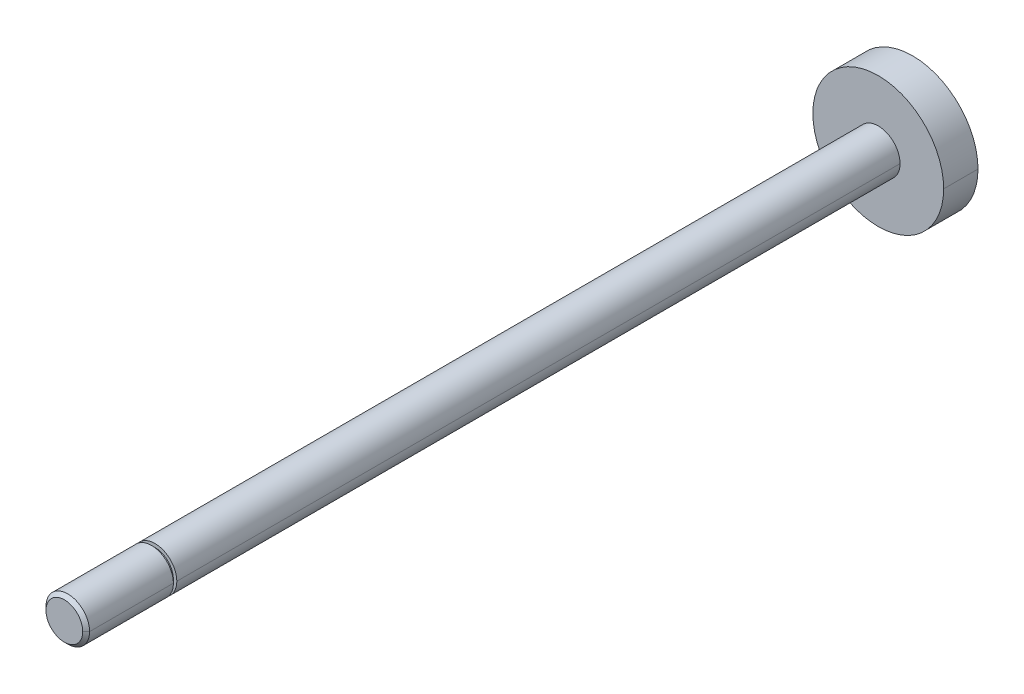
ISO-10303-21;
HEADER;
FILE_DESCRIPTION(('STEP AP214'),'2;1');
FILE_NAME('part.step','',(''),(''),'','','');
FILE_SCHEMA(('AUTOMOTIVE_DESIGN { 1 0 10303 214 1 1 1 1 }'));
ENDSEC;
DATA;
#1=APPLICATION_CONTEXT('core data for automotive mechanical design processes');
#2=APPLICATION_PROTOCOL_DEFINITION('international standard','automotive_design',2000,#1);
#3=PRODUCT_CONTEXT('',#1,'mechanical');
#4=PRODUCT('Part','Part','',(#3));
#5=PRODUCT_RELATED_PRODUCT_CATEGORY('part','',(#4));
#6=PRODUCT_DEFINITION_FORMATION('','',#4);
#7=PRODUCT_DEFINITION_CONTEXT('part definition',#1,'design');
#8=PRODUCT_DEFINITION('design','',#6,#7);
#9=PRODUCT_DEFINITION_SHAPE('','',#8);
#10=(LENGTH_UNIT() NAMED_UNIT(*) SI_UNIT(.MILLI.,.METRE.));
#11=(NAMED_UNIT(*) PLANE_ANGLE_UNIT() SI_UNIT($,.RADIAN.));
#12=(NAMED_UNIT(*) SI_UNIT($,.STERADIAN.) SOLID_ANGLE_UNIT());
#13=UNCERTAINTY_MEASURE_WITH_UNIT(LENGTH_MEASURE(1.E-05),#10,'distance_accuracy_value','');
#14=(GEOMETRIC_REPRESENTATION_CONTEXT(3) GLOBAL_UNCERTAINTY_ASSIGNED_CONTEXT((#13)) GLOBAL_UNIT_ASSIGNED_CONTEXT((#10,
#11,#12)) REPRESENTATION_CONTEXT('',''));
#15=CARTESIAN_POINT('',(0.,0.,0.));
#16=DIRECTION('',(0.,0.,1.));
#17=DIRECTION('',(1.,0.,0.));
#18=AXIS2_PLACEMENT_3D('',#15,#16,#17);
#19=CARTESIAN_POINT('',(0.,0.,121.031));
#20=DIRECTION('',(0.,0.,-1.));
#21=DIRECTION('',(0.,-1.,0.));
#22=AXIS2_PLACEMENT_3D('',#19,#20,#21);
#23=PLANE('',#22);
#24=CARTESIAN_POINT('',(0.,0.,121.031));
#25=DIRECTION('',(0.,0.,-1.));
#26=DIRECTION('',(-1.,0.,0.));
#27=AXIS2_PLACEMENT_3D('',#24,#25,#26);
#28=CIRCLE('',#27,2.675);
#29=CARTESIAN_POINT('',(-2.675,0.,121.031));
#30=VERTEX_POINT('',#29);
#31=CARTESIAN_POINT('',(2.675,0.,121.031));
#32=VERTEX_POINT('',#31);
#33=EDGE_CURVE('E558',#30,#32,#28,.T.);
#34=ORIENTED_EDGE('',*,*,#33,.F.);
#35=CARTESIAN_POINT('',(0.,0.,121.031));
#36=DIRECTION('',(0.,0.,-1.));
#37=DIRECTION('',(-1.,0.,0.));
#38=AXIS2_PLACEMENT_3D('',#35,#36,#37);
#39=CIRCLE('',#38,2.675);
#40=EDGE_CURVE('E11',#32,#30,#39,.T.);
#41=ORIENTED_EDGE('',*,*,#40,.F.);
#42=EDGE_LOOP('',(#34,#41));
#43=FACE_BOUND('',#42,.T.);
#44=ADVANCED_FACE('F16',(#43),#23,.F.);
#45=CARTESIAN_POINT('',(0.,0.,121.031));
#46=DIRECTION('',(0.,0.,-1.));
#47=DIRECTION('',(-1.,0.,0.));
#48=AXIS2_PLACEMENT_3D('',#45,#46,#47);
#49=CONICAL_SURFACE('',#48,2.675,0.785398163397466);
#50=DIRECTION('',(0.70710678118656,0.,-0.707106781186535));
#51=VECTOR('',#50,1.);
#52=CARTESIAN_POINT('',(2.675,0.,121.031));
#53=LINE('',#52,#51);
#54=CARTESIAN_POINT('',(3.175,0.,120.531));
#55=VERTEX_POINT('',#54);
#56=EDGE_CURVE('E553',#32,#55,#53,.T.);
#57=ORIENTED_EDGE('',*,*,#56,.F.);
#58=ORIENTED_EDGE('',*,*,#40,.T.);
#59=DIRECTION('',(-0.70710678118656,0.,-0.707106781186535));
#60=VECTOR('',#59,1.);
#61=CARTESIAN_POINT('',(-2.675,0.,121.031));
#62=LINE('',#61,#60);
#63=CARTESIAN_POINT('',(-3.175,0.,120.531));
#64=VERTEX_POINT('',#63);
#65=EDGE_CURVE('E182',#30,#64,#62,.T.);
#66=ORIENTED_EDGE('',*,*,#65,.T.);
#67=CARTESIAN_POINT('',(0.,0.,120.531));
#68=DIRECTION('',(0.,0.,-1.));
#69=DIRECTION('',(-1.,0.,0.));
#70=AXIS2_PLACEMENT_3D('',#67,#68,#69);
#71=CIRCLE('',#70,3.175);
#72=EDGE_CURVE('E26',#55,#64,#71,.T.);
#73=ORIENTED_EDGE('',*,*,#72,.F.);
#74=EDGE_LOOP('',(#57,#58,#66,#73));
#75=FACE_BOUND('',#74,.T.);
#76=ADVANCED_FACE('F325',(#75),#49,.T.);
#77=CARTESIAN_POINT('',(0.,0.,130.011256121069));
#78=DIRECTION('',(0.,0.,-1.));
#79=DIRECTION('',(-1.,0.,0.));
#80=AXIS2_PLACEMENT_3D('',#77,#78,#79);
#81=CYLINDRICAL_SURFACE('',#80,3.175);
#82=DIRECTION('',(0.,0.,-1.));
#83=VECTOR('',#82,1.);
#84=CARTESIAN_POINT('',(3.175,0.,130.011256121069));
#85=LINE('',#84,#83);
#86=CARTESIAN_POINT('',(3.175,0.,108.331));
#87=VERTEX_POINT('',#86);
#88=EDGE_CURVE('E186',#55,#87,#85,.T.);
#89=ORIENTED_EDGE('',*,*,#88,.F.);
#90=ORIENTED_EDGE('',*,*,#72,.T.);
#91=DIRECTION('',(0.,0.,-1.));
#92=VECTOR('',#91,1.);
#93=CARTESIAN_POINT('',(-3.175,0.,130.011256121069));
#94=LINE('',#93,#92);
#95=CARTESIAN_POINT('',(-3.175,0.,108.331));
#96=VERTEX_POINT('',#95);
#97=EDGE_CURVE('E191',#64,#96,#94,.T.);
#98=ORIENTED_EDGE('',*,*,#97,.T.);
#99=CARTESIAN_POINT('',(0.,0.,108.331));
#100=DIRECTION('',(0.,0.,-1.));
#101=DIRECTION('',(-1.,0.,0.));
#102=AXIS2_PLACEMENT_3D('',#99,#100,#101);
#103=CIRCLE('',#102,3.175);
#104=EDGE_CURVE('E148',#87,#96,#103,.T.);
#105=ORIENTED_EDGE('',*,*,#104,.F.);
#106=EDGE_LOOP('',(#89,#90,#98,#105));
#107=FACE_BOUND('',#106,.T.);
#108=ADVANCED_FACE('F398',(#107),#81,.T.);
#109=CARTESIAN_POINT('',(0.,0.,0.));
#110=DIRECTION('',(0.,0.,-1.));
#111=DIRECTION('',(-1.,0.,0.));
#112=AXIS2_PLACEMENT_3D('',#109,#110,#111);
#113=CYLINDRICAL_SURFACE('',#112,2.675);
#114=DIRECTION('',(0.,0.,-1.));
#115=VECTOR('',#114,1.);
#116=CARTESIAN_POINT('',(2.675,0.,0.));
#117=LINE('',#116,#115);
#118=CARTESIAN_POINT('',(2.675,0.,108.331));
#119=VERTEX_POINT('',#118);
#120=CARTESIAN_POINT('',(2.675,0.,107.831));
#121=VERTEX_POINT('',#120);
#122=EDGE_CURVE('E176',#119,#121,#117,.T.);
#123=ORIENTED_EDGE('',*,*,#122,.F.);
#124=CARTESIAN_POINT('',(0.,0.,108.331));
#125=DIRECTION('',(0.,0.,-1.));
#126=DIRECTION('',(-1.,0.,0.));
#127=AXIS2_PLACEMENT_3D('',#124,#125,#126);
#128=CIRCLE('',#127,2.675);
#129=CARTESIAN_POINT('',(-2.675,0.,108.331));
#130=VERTEX_POINT('',#129);
#131=EDGE_CURVE('E147',#119,#130,#128,.T.);
#132=ORIENTED_EDGE('',*,*,#131,.T.);
#133=DIRECTION('',(0.,0.,-1.));
#134=VECTOR('',#133,1.);
#135=CARTESIAN_POINT('',(-2.675,0.,0.));
#136=LINE('',#135,#134);
#137=CARTESIAN_POINT('',(-2.675,0.,107.831));
#138=VERTEX_POINT('',#137);
#139=EDGE_CURVE('E145',#130,#138,#136,.T.);
#140=ORIENTED_EDGE('',*,*,#139,.T.);
#141=CARTESIAN_POINT('',(0.,0.,107.831));
#142=DIRECTION('',(0.,0.,-1.));
#143=DIRECTION('',(-1.,0.,0.));
#144=AXIS2_PLACEMENT_3D('',#141,#142,#143);
#145=CIRCLE('',#144,2.675);
#146=EDGE_CURVE('E19',#121,#138,#145,.T.);
#147=ORIENTED_EDGE('',*,*,#146,.F.);
#148=EDGE_LOOP('',(#123,#132,#140,#147));
#149=FACE_BOUND('',#148,.T.);
#150=ADVANCED_FACE('F206',(#149),#113,.T.);
#151=CARTESIAN_POINT('',(0.,3.175,108.331));
#152=DIRECTION('',(0.,0.,1.));
#153=DIRECTION('',(1.,0.,0.));
#154=AXIS2_PLACEMENT_3D('',#151,#152,#153);
#155=PLANE('',#154);
#156=CARTESIAN_POINT('',(0.,0.,108.331));
#157=DIRECTION('',(0.,0.,-1.));
#158=DIRECTION('',(-1.,0.,0.));
#159=AXIS2_PLACEMENT_3D('',#156,#157,#158);
#160=CIRCLE('',#159,2.675);
#161=EDGE_CURVE('E188',#130,#119,#160,.T.);
#162=ORIENTED_EDGE('',*,*,#161,.F.);
#163=ORIENTED_EDGE('',*,*,#131,.F.);
#164=EDGE_LOOP('',(#162,#163));
#165=FACE_BOUND('',#164,.T.);
#166=CARTESIAN_POINT('',(0.,0.,108.331));
#167=DIRECTION('',(0.,0.,-1.));
#168=DIRECTION('',(-1.,0.,0.));
#169=AXIS2_PLACEMENT_3D('',#166,#167,#168);
#170=CIRCLE('',#169,3.175);
#171=EDGE_CURVE('E198',#96,#87,#170,.T.);
#172=ORIENTED_EDGE('',*,*,#171,.T.);
#173=ORIENTED_EDGE('',*,*,#104,.T.);
#174=EDGE_LOOP('',(#172,#173));
#175=FACE_BOUND('',#174,.T.);
#176=ADVANCED_FACE('F215',(#165,#175),#155,.F.);
#177=CARTESIAN_POINT('',(0.,2.675,107.831));
#178=DIRECTION('',(0.,0.,-1.));
#179=DIRECTION('',(0.,-1.,0.));
#180=AXIS2_PLACEMENT_3D('',#177,#178,#179);
#181=PLANE('',#180);
#182=CARTESIAN_POINT('',(0.,0.,107.831));
#183=DIRECTION('',(0.,0.,-1.));
#184=DIRECTION('',(-1.,0.,0.));
#185=AXIS2_PLACEMENT_3D('',#182,#183,#184);
#186=CIRCLE('',#185,2.675);
#187=EDGE_CURVE('E179',#138,#121,#186,.T.);
#188=ORIENTED_EDGE('',*,*,#187,.T.);
#189=ORIENTED_EDGE('',*,*,#146,.T.);
#190=EDGE_LOOP('',(#188,#189));
#191=FACE_BOUND('',#190,.T.);
#192=CARTESIAN_POINT('',(0.,0.,107.831));
#193=DIRECTION('',(0.,0.,-1.));
#194=DIRECTION('',(-1.,0.,0.));
#195=AXIS2_PLACEMENT_3D('',#192,#193,#194);
#196=CIRCLE('',#195,3.175);
#197=CARTESIAN_POINT('',(-3.175,0.,107.831));
#198=VERTEX_POINT('',#197);
#199=CARTESIAN_POINT('',(3.175,0.,107.831));
#200=VERTEX_POINT('',#199);
#201=EDGE_CURVE('E140',#198,#200,#196,.T.);
#202=ORIENTED_EDGE('',*,*,#201,.F.);
#203=CARTESIAN_POINT('',(0.,0.,107.831));
#204=DIRECTION('',(0.,0.,-1.));
#205=DIRECTION('',(-1.,0.,0.));
#206=AXIS2_PLACEMENT_3D('',#203,#204,#205);
#207=CIRCLE('',#206,3.175);
#208=EDGE_CURVE('E159',#200,#198,#207,.T.);
#209=ORIENTED_EDGE('',*,*,#208,.F.);
#210=EDGE_LOOP('',(#202,#209));
#211=FACE_BOUND('',#210,.T.);
#212=ADVANCED_FACE('F211',(#191,#211),#181,.F.);
#213=CARTESIAN_POINT('',(0.,0.,130.011256121069));
#214=DIRECTION('',(0.,0.,-1.));
#215=DIRECTION('',(-1.,0.,0.));
#216=AXIS2_PLACEMENT_3D('',#213,#214,#215);
#217=CYLINDRICAL_SURFACE('',#216,3.175);
#218=DIRECTION('',(0.,0.,-1.));
#219=VECTOR('',#218,1.);
#220=CARTESIAN_POINT('',(3.175,0.,130.011256121069));
#221=LINE('',#220,#219);
#222=CARTESIAN_POINT('',(3.175,0.,2.5));
#223=VERTEX_POINT('',#222);
#224=EDGE_CURVE('E144',#200,#223,#221,.T.);
#225=ORIENTED_EDGE('',*,*,#224,.F.);
#226=ORIENTED_EDGE('',*,*,#208,.T.);
#227=DIRECTION('',(0.,0.,-1.));
#228=VECTOR('',#227,1.);
#229=CARTESIAN_POINT('',(-3.175,0.,130.011256121069));
#230=LINE('',#229,#228);
#231=CARTESIAN_POINT('',(-3.175,0.,2.5));
#232=VERTEX_POINT('',#231);
#233=EDGE_CURVE('E127',#198,#232,#230,.T.);
#234=ORIENTED_EDGE('',*,*,#233,.T.);
#235=CARTESIAN_POINT('',(0.,0.,2.5));
#236=DIRECTION('',(0.,0.,1.));
#237=DIRECTION('',(1.,0.,0.));
#238=AXIS2_PLACEMENT_3D('',#235,#236,#237);
#239=CIRCLE('',#238,3.175);
#240=EDGE_CURVE('E117',#232,#223,#239,.T.);
#241=ORIENTED_EDGE('',*,*,#240,.T.);
#242=EDGE_LOOP('',(#225,#226,#234,#241));
#243=FACE_BOUND('',#242,.T.);
#244=ADVANCED_FACE('F214',(#243),#217,.T.);
#245=CARTESIAN_POINT('',(0.,0.,-2.5));
#246=DIRECTION('',(0.,0.,1.));
#247=DIRECTION('',(1.,0.,0.));
#248=AXIS2_PLACEMENT_3D('',#245,#246,#247);
#249=PLANE('',#248);
#250=CARTESIAN_POINT('',(0.,0.,-2.5));
#251=DIRECTION('',(0.,0.,1.));
#252=DIRECTION('',(1.,0.,0.));
#253=AXIS2_PLACEMENT_3D('',#250,#251,#252);
#254=CIRCLE('',#253,9.525);
#255=CARTESIAN_POINT('',(-9.525,0.,-2.5));
#256=VERTEX_POINT('',#255);
#257=CARTESIAN_POINT('',(9.525,0.,-2.5));
#258=VERTEX_POINT('',#257);
#259=EDGE_CURVE('E40',#256,#258,#254,.T.);
#260=ORIENTED_EDGE('',*,*,#259,.F.);
#261=CARTESIAN_POINT('',(0.,0.,-2.5));
#262=DIRECTION('',(0.,0.,1.));
#263=DIRECTION('',(1.,0.,0.));
#264=AXIS2_PLACEMENT_3D('',#261,#262,#263);
#265=CIRCLE('',#264,9.525);
#266=EDGE_CURVE('E122',#258,#256,#265,.T.);
#267=ORIENTED_EDGE('',*,*,#266,.F.);
#268=EDGE_LOOP('',(#260,#267));
#269=FACE_BOUND('',#268,.T.);
#270=ADVANCED_FACE('F378',(#269),#249,.F.);
#271=CARTESIAN_POINT('',(0.,0.,2.5));
#272=DIRECTION('',(0.,0.,-1.));
#273=DIRECTION('',(-1.,0.,0.));
#274=AXIS2_PLACEMENT_3D('',#271,#272,#273);
#275=CYLINDRICAL_SURFACE('',#274,9.525);
#276=DIRECTION('',(0.,0.,-1.));
#277=VECTOR('',#276,1.);
#278=CARTESIAN_POINT('',(9.525,0.,2.5));
#279=LINE('',#278,#277);
#280=CARTESIAN_POINT('',(9.525,0.,2.5));
#281=VERTEX_POINT('',#280);
#282=EDGE_CURVE('E114',#281,#258,#279,.T.);
#283=ORIENTED_EDGE('',*,*,#282,.F.);
#284=CARTESIAN_POINT('',(0.,0.,2.5));
#285=DIRECTION('',(0.,0.,1.));
#286=DIRECTION('',(1.,0.,0.));
#287=AXIS2_PLACEMENT_3D('',#284,#285,#286);
#288=CIRCLE('',#287,9.525);
#289=CARTESIAN_POINT('',(-9.525,0.,2.5));
#290=VERTEX_POINT('',#289);
#291=EDGE_CURVE('E103',#290,#281,#288,.T.);
#292=ORIENTED_EDGE('',*,*,#291,.F.);
#293=DIRECTION('',(0.,0.,-1.));
#294=VECTOR('',#293,1.);
#295=CARTESIAN_POINT('',(-9.525,0.,2.5));
#296=LINE('',#295,#294);
#297=EDGE_CURVE('E111',#290,#256,#296,.T.);
#298=ORIENTED_EDGE('',*,*,#297,.T.);
#299=ORIENTED_EDGE('',*,*,#259,.T.);
#300=EDGE_LOOP('',(#283,#292,#298,#299));
#301=FACE_BOUND('',#300,.T.);
#302=ADVANCED_FACE('F110',(#301),#275,.T.);
#303=CARTESIAN_POINT('',(0.,0.,2.5));
#304=DIRECTION('',(0.,0.,1.));
#305=DIRECTION('',(1.,0.,0.));
#306=AXIS2_PLACEMENT_3D('',#303,#304,#305);
#307=PLANE('',#306);
#308=ORIENTED_EDGE('',*,*,#240,.F.);
#309=CARTESIAN_POINT('',(0.,0.,2.5));
#310=DIRECTION('',(0.,0.,1.));
#311=DIRECTION('',(1.,0.,0.));
#312=AXIS2_PLACEMENT_3D('',#309,#310,#311);
#313=CIRCLE('',#312,3.175);
#314=EDGE_CURVE('E136',#223,#232,#313,.T.);
#315=ORIENTED_EDGE('',*,*,#314,.F.);
#316=EDGE_LOOP('',(#308,#315));
#317=FACE_BOUND('',#316,.T.);
#318=ORIENTED_EDGE('',*,*,#291,.T.);
#319=CARTESIAN_POINT('',(0.,0.,2.5));
#320=DIRECTION('',(0.,0.,1.));
#321=DIRECTION('',(1.,0.,0.));
#322=AXIS2_PLACEMENT_3D('',#319,#320,#321);
#323=CIRCLE('',#322,9.525);
#324=EDGE_CURVE('E121',#281,#290,#323,.T.);
#325=ORIENTED_EDGE('',*,*,#324,.T.);
#326=EDGE_LOOP('',(#318,#325));
#327=FACE_BOUND('',#326,.T.);
#328=ADVANCED_FACE('F125',(#317,#327),#307,.T.);
#329=CARTESIAN_POINT('',(0.,0.,2.5));
#330=DIRECTION('',(0.,0.,-1.));
#331=DIRECTION('',(-1.,0.,0.));
#332=AXIS2_PLACEMENT_3D('',#329,#330,#331);
#333=CYLINDRICAL_SURFACE('',#332,9.525);
#334=ORIENTED_EDGE('',*,*,#324,.F.);
#335=ORIENTED_EDGE('',*,*,#282,.T.);
#336=ORIENTED_EDGE('',*,*,#266,.T.);
#337=ORIENTED_EDGE('',*,*,#297,.F.);
#338=EDGE_LOOP('',(#334,#335,#336,#337));
#339=FACE_BOUND('',#338,.T.);
#340=ADVANCED_FACE('F120',(#339),#333,.T.);
#341=CARTESIAN_POINT('',(0.,0.,130.011256121069));
#342=DIRECTION('',(0.,0.,-1.));
#343=DIRECTION('',(-1.,0.,0.));
#344=AXIS2_PLACEMENT_3D('',#341,#342,#343);
#345=CYLINDRICAL_SURFACE('',#344,3.175);
#346=ORIENTED_EDGE('',*,*,#201,.T.);
#347=ORIENTED_EDGE('',*,*,#224,.T.);
#348=ORIENTED_EDGE('',*,*,#314,.T.);
#349=ORIENTED_EDGE('',*,*,#233,.F.);
#350=EDGE_LOOP('',(#346,#347,#348,#349));
#351=FACE_BOUND('',#350,.T.);
#352=ADVANCED_FACE('F220',(#351),#345,.T.);
#353=CARTESIAN_POINT('',(0.,0.,0.));
#354=DIRECTION('',(0.,0.,-1.));
#355=DIRECTION('',(-1.,0.,0.));
#356=AXIS2_PLACEMENT_3D('',#353,#354,#355);
#357=CYLINDRICAL_SURFACE('',#356,2.675);
#358=ORIENTED_EDGE('',*,*,#161,.T.);
#359=ORIENTED_EDGE('',*,*,#122,.T.);
#360=ORIENTED_EDGE('',*,*,#187,.F.);
#361=ORIENTED_EDGE('',*,*,#139,.F.);
#362=EDGE_LOOP('',(#358,#359,#360,#361));
#363=FACE_BOUND('',#362,.T.);
#364=ADVANCED_FACE('F210',(#363),#357,.T.);
#365=CARTESIAN_POINT('',(0.,0.,130.011256121069));
#366=DIRECTION('',(0.,0.,-1.));
#367=DIRECTION('',(-1.,0.,0.));
#368=AXIS2_PLACEMENT_3D('',#365,#366,#367);
#369=CYLINDRICAL_SURFACE('',#368,3.175);
#370=CARTESIAN_POINT('',(0.,0.,120.531));
#371=DIRECTION('',(0.,0.,-1.));
#372=DIRECTION('',(-1.,0.,0.));
#373=AXIS2_PLACEMENT_3D('',#370,#371,#372);
#374=CIRCLE('',#373,3.175);
#375=EDGE_CURVE('E187',#64,#55,#374,.T.);
#376=ORIENTED_EDGE('',*,*,#375,.T.);
#377=ORIENTED_EDGE('',*,*,#88,.T.);
#378=ORIENTED_EDGE('',*,*,#171,.F.);
#379=ORIENTED_EDGE('',*,*,#97,.F.);
#380=EDGE_LOOP('',(#376,#377,#378,#379));
#381=FACE_BOUND('',#380,.T.);
#382=ADVANCED_FACE('F356',(#381),#369,.T.);
#383=CARTESIAN_POINT('',(0.,0.,121.031));
#384=DIRECTION('',(0.,0.,-1.));
#385=DIRECTION('',(-1.,0.,0.));
#386=AXIS2_PLACEMENT_3D('',#383,#384,#385);
#387=CONICAL_SURFACE('',#386,2.675,0.785398163397466);
#388=ORIENTED_EDGE('',*,*,#33,.T.);
#389=ORIENTED_EDGE('',*,*,#56,.T.);
#390=ORIENTED_EDGE('',*,*,#375,.F.);
#391=ORIENTED_EDGE('',*,*,#65,.F.);
#392=EDGE_LOOP('',(#388,#389,#390,#391));
#393=FACE_BOUND('',#392,.T.);
#394=ADVANCED_FACE('F363',(#393),#387,.T.);
#395=CLOSED_SHELL('',(#44,#76,#108,#150,#176,#212,#244,#270,#302,#328,#340,#352,#364,#382,#394));
#396=MANIFOLD_SOLID_BREP('B1',#395);
#397=ADVANCED_BREP_SHAPE_REPRESENTATION('',(#18,#396),#14);
#398=SHAPE_DEFINITION_REPRESENTATION(#9,#397);
ENDSEC;
END-ISO-10303-21;
